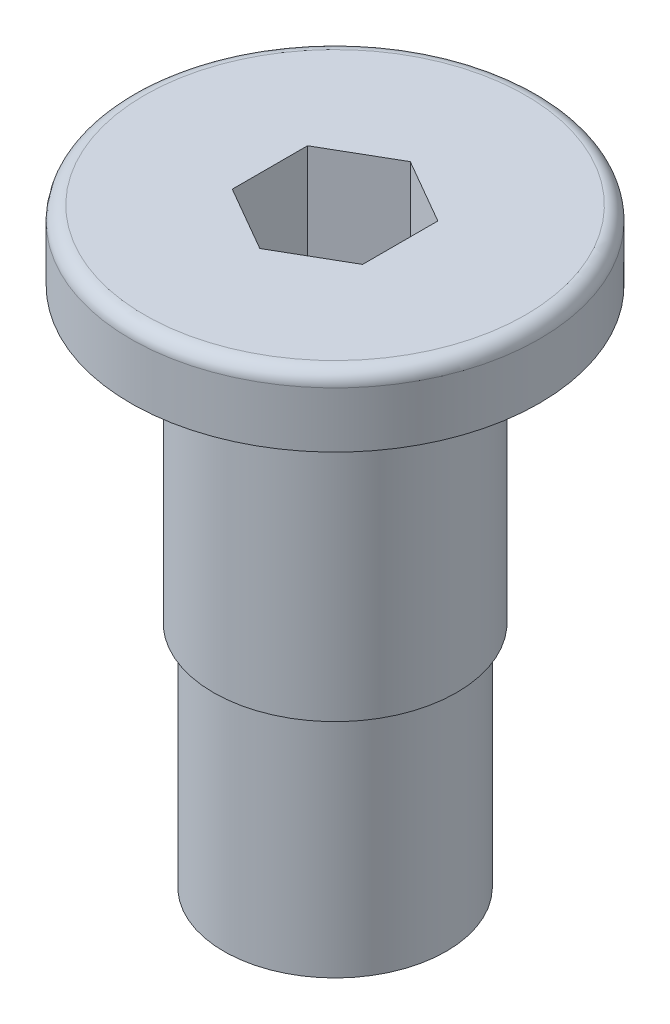
ISO-10303-21;
HEADER;
FILE_DESCRIPTION(('STEP AP214'),'2;1');
FILE_NAME('part.step','',(''),(''),'','','');
FILE_SCHEMA(('AUTOMOTIVE_DESIGN { 1 0 10303 214 1 1 1 1 }'));
ENDSEC;
DATA;
#1=APPLICATION_CONTEXT('core data for automotive mechanical design processes');
#2=APPLICATION_PROTOCOL_DEFINITION('international standard','automotive_design',2000,#1);
#3=PRODUCT_CONTEXT('',#1,'mechanical');
#4=PRODUCT('Part','Part','',(#3));
#5=PRODUCT_RELATED_PRODUCT_CATEGORY('part','',(#4));
#6=PRODUCT_DEFINITION_FORMATION('','',#4);
#7=PRODUCT_DEFINITION_CONTEXT('part definition',#1,'design');
#8=PRODUCT_DEFINITION('design','',#6,#7);
#9=PRODUCT_DEFINITION_SHAPE('','',#8);
#10=(LENGTH_UNIT() NAMED_UNIT(*) SI_UNIT(.MILLI.,.METRE.));
#11=(NAMED_UNIT(*) PLANE_ANGLE_UNIT() SI_UNIT($,.RADIAN.));
#12=(NAMED_UNIT(*) SI_UNIT($,.STERADIAN.) SOLID_ANGLE_UNIT());
#13=UNCERTAINTY_MEASURE_WITH_UNIT(LENGTH_MEASURE(1.E-05),#10,'distance_accuracy_value','');
#14=(GEOMETRIC_REPRESENTATION_CONTEXT(3) GLOBAL_UNCERTAINTY_ASSIGNED_CONTEXT((#13)) GLOBAL_UNIT_ASSIGNED_CONTEXT((#10,
#11,#12)) REPRESENTATION_CONTEXT('',''));
#15=CARTESIAN_POINT('',(0.,0.,0.));
#16=DIRECTION('',(0.,0.,1.));
#17=DIRECTION('',(1.,0.,0.));
#18=AXIS2_PLACEMENT_3D('',#15,#16,#17);
#19=CARTESIAN_POINT('',(0.,-1.27,1.3748153285078));
#20=DIRECTION('',(0.5,0.,0.866025403784439));
#21=DIRECTION('',(0.866025403784439,0.,-0.5));
#22=AXIS2_PLACEMENT_3D('',#19,#20,#21);
#23=PLANE('',#22);
#24=DIRECTION('',(0.,1.,0.));
#25=VECTOR('',#24,1.);
#26=CARTESIAN_POINT('',(1.190625,-1.27,0.687407664253899));
#27=LINE('',#26,#25);
#28=CARTESIAN_POINT('',(1.190625,1.27,0.6874076642539));
#29=VERTEX_POINT('',#28);
#30=CARTESIAN_POINT('',(1.190625,-1.27,0.687407664253899));
#31=VERTEX_POINT('',#30);
#32=EDGE_CURVE('E85',#29,#31,#27,.F.);
#33=ORIENTED_EDGE('',*,*,#32,.T.);
#34=DIRECTION('',(0.866025403784439,0.,-0.5));
#35=VECTOR('',#34,1.);
#36=CARTESIAN_POINT('',(0.,-1.27,1.3748153285078));
#37=LINE('',#36,#35);
#38=CARTESIAN_POINT('',(0.,-1.27,1.3748153285078));
#39=VERTEX_POINT('',#38);
#40=EDGE_CURVE('E74',#39,#31,#37,.T.);
#41=ORIENTED_EDGE('',*,*,#40,.F.);
#42=DIRECTION('',(0.,1.,0.));
#43=VECTOR('',#42,1.);
#44=CARTESIAN_POINT('',(0.,-1.27,1.3748153285078));
#45=LINE('',#44,#43);
#46=CARTESIAN_POINT('',(0.,1.27,1.3748153285078));
#47=VERTEX_POINT('',#46);
#48=EDGE_CURVE('E94',#39,#47,#45,.T.);
#49=ORIENTED_EDGE('',*,*,#48,.T.);
#50=DIRECTION('',(0.866025403784439,0.,-0.5));
#51=VECTOR('',#50,1.);
#52=CARTESIAN_POINT('',(0.,1.27,1.3748153285078));
#53=LINE('',#52,#51);
#54=EDGE_CURVE('E69',#29,#47,#53,.F.);
#55=ORIENTED_EDGE('',*,*,#54,.F.);
#56=EDGE_LOOP('',(#33,#41,#49,#55));
#57=FACE_BOUND('',#56,.T.);
#58=ADVANCED_FACE('F14',(#57),#23,.F.);
#59=CARTESIAN_POINT('',(1.190625,-1.27,0.687407664253899));
#60=DIRECTION('',(1.,0.,0.));
#61=DIRECTION('',(0.,1.,0.));
#62=AXIS2_PLACEMENT_3D('',#59,#60,#61);
#63=PLANE('',#62);
#64=DIRECTION('',(0.,1.,0.));
#65=VECTOR('',#64,1.);
#66=CARTESIAN_POINT('',(1.190625,-1.27,-0.687407664253897));
#67=LINE('',#66,#65);
#68=CARTESIAN_POINT('',(1.190625,1.27,-0.687407664253898));
#69=VERTEX_POINT('',#68);
#70=CARTESIAN_POINT('',(1.190625,-1.27,-0.687407664253898));
#71=VERTEX_POINT('',#70);
#72=EDGE_CURVE('E90',#69,#71,#67,.F.);
#73=ORIENTED_EDGE('',*,*,#72,.T.);
#74=DIRECTION('',(0.,0.,1.));
#75=VECTOR('',#74,1.);
#76=CARTESIAN_POINT('',(1.190625,-1.27,0.687407664253899));
#77=LINE('',#76,#75);
#78=EDGE_CURVE('E78',#31,#71,#77,.F.);
#79=ORIENTED_EDGE('',*,*,#78,.F.);
#80=ORIENTED_EDGE('',*,*,#32,.F.);
#81=DIRECTION('',(0.,0.,1.));
#82=VECTOR('',#81,1.);
#83=CARTESIAN_POINT('',(1.190625,1.27,0.687407664253899));
#84=LINE('',#83,#82);
#85=EDGE_CURVE('E92',#69,#29,#84,.T.);
#86=ORIENTED_EDGE('',*,*,#85,.F.);
#87=EDGE_LOOP('',(#73,#79,#80,#86));
#88=FACE_BOUND('',#87,.T.);
#89=ADVANCED_FACE('F88',(#88),#63,.F.);
#90=CARTESIAN_POINT('',(-1.190625,-1.27,0.687407664253898));
#91=DIRECTION('',(-0.5,0.,0.866025403784439));
#92=DIRECTION('',(0.866025403784439,0.,0.5));
#93=AXIS2_PLACEMENT_3D('',#90,#91,#92);
#94=PLANE('',#93);
#95=ORIENTED_EDGE('',*,*,#48,.F.);
#96=DIRECTION('',(0.866025403784439,0.,0.5));
#97=VECTOR('',#96,1.);
#98=CARTESIAN_POINT('',(-1.190625,-1.27,0.687407664253898));
#99=LINE('',#98,#97);
#100=CARTESIAN_POINT('',(-1.190625,-1.27,0.687407664253898));
#101=VERTEX_POINT('',#100);
#102=EDGE_CURVE('E81',#101,#39,#99,.T.);
#103=ORIENTED_EDGE('',*,*,#102,.F.);
#104=DIRECTION('',(0.,-1.,0.));
#105=VECTOR('',#104,1.);
#106=CARTESIAN_POINT('',(-1.190625,-1.27,0.687407664253898));
#107=LINE('',#106,#105);
#108=CARTESIAN_POINT('',(-1.190625,1.27,0.687407664253898));
#109=VERTEX_POINT('',#108);
#110=EDGE_CURVE('E155',#101,#109,#107,.F.);
#111=ORIENTED_EDGE('',*,*,#110,.T.);
#112=DIRECTION('',(0.866025403784439,0.,0.5));
#113=VECTOR('',#112,1.);
#114=CARTESIAN_POINT('',(-1.190625,1.27,0.687407664253897));
#115=LINE('',#114,#113);
#116=EDGE_CURVE('E167',#47,#109,#115,.F.);
#117=ORIENTED_EDGE('',*,*,#116,.F.);
#118=EDGE_LOOP('',(#95,#103,#111,#117));
#119=FACE_BOUND('',#118,.T.);
#120=ADVANCED_FACE('F170',(#119),#94,.F.);
#121=CARTESIAN_POINT('',(1.190625,-1.27,-0.687407664253898));
#122=DIRECTION('',(0.5,0.,-0.866025403784439));
#123=DIRECTION('',(-0.866025403784439,0.,-0.5));
#124=AXIS2_PLACEMENT_3D('',#121,#122,#123);
#125=PLANE('',#124);
#126=DIRECTION('',(0.,1.,0.));
#127=VECTOR('',#126,1.);
#128=CARTESIAN_POINT('',(0.,-1.27,-1.3748153285078));
#129=LINE('',#128,#127);
#130=CARTESIAN_POINT('',(0.,1.27,-1.3748153285078));
#131=VERTEX_POINT('',#130);
#132=CARTESIAN_POINT('',(0.,-1.27,-1.3748153285078));
#133=VERTEX_POINT('',#132);
#134=EDGE_CURVE('E150',#131,#133,#129,.F.);
#135=ORIENTED_EDGE('',*,*,#134,.T.);
#136=DIRECTION('',(-0.866025403784439,0.,-0.5));
#137=VECTOR('',#136,1.);
#138=CARTESIAN_POINT('',(1.190625,-1.27,-0.687407664253898));
#139=LINE('',#138,#137);
#140=EDGE_CURVE('E161',#71,#133,#139,.T.);
#141=ORIENTED_EDGE('',*,*,#140,.F.);
#142=ORIENTED_EDGE('',*,*,#72,.F.);
#143=DIRECTION('',(-0.866025403784439,0.,-0.5));
#144=VECTOR('',#143,1.);
#145=CARTESIAN_POINT('',(1.190625,1.27,-0.6874076642539));
#146=LINE('',#145,#144);
#147=EDGE_CURVE('E163',#131,#69,#146,.F.);
#148=ORIENTED_EDGE('',*,*,#147,.F.);
#149=EDGE_LOOP('',(#135,#141,#142,#148));
#150=FACE_BOUND('',#149,.T.);
#151=ADVANCED_FACE('F180',(#150),#125,.F.);
#152=CARTESIAN_POINT('',(0.,-1.27,-1.3748153285078));
#153=DIRECTION('',(0.,1.,0.));
#154=DIRECTION('',(-1.,0.,0.));
#155=AXIS2_PLACEMENT_3D('',#152,#153,#154);
#156=PLANE('',#155);
#157=ORIENTED_EDGE('',*,*,#40,.T.);
#158=ORIENTED_EDGE('',*,*,#78,.T.);
#159=ORIENTED_EDGE('',*,*,#140,.T.);
#160=DIRECTION('',(-0.866025403784439,0.,0.5));
#161=VECTOR('',#160,1.);
#162=CARTESIAN_POINT('',(0.,-1.27,-1.3748153285078));
#163=LINE('',#162,#161);
#164=CARTESIAN_POINT('',(-1.190625,-1.27,-0.687407664253899));
#165=VERTEX_POINT('',#164);
#166=EDGE_CURVE('E148',#133,#165,#163,.T.);
#167=ORIENTED_EDGE('',*,*,#166,.T.);
#168=DIRECTION('',(0.,0.,1.));
#169=VECTOR('',#168,1.);
#170=CARTESIAN_POINT('',(-1.190625,-1.27,-0.687407664253899));
#171=LINE('',#170,#169);
#172=EDGE_CURVE('E158',#165,#101,#171,.T.);
#173=ORIENTED_EDGE('',*,*,#172,.T.);
#174=ORIENTED_EDGE('',*,*,#102,.T.);
#175=EDGE_LOOP('',(#157,#158,#159,#167,#173,#174));
#176=FACE_BOUND('',#175,.T.);
#177=ADVANCED_FACE('F75',(#176),#156,.T.);
#178=CARTESIAN_POINT('',(-1.190625,-1.27,-0.687407664253899));
#179=DIRECTION('',(-1.,0.,0.));
#180=DIRECTION('',(0.,-1.,0.));
#181=AXIS2_PLACEMENT_3D('',#178,#179,#180);
#182=PLANE('',#181);
#183=ORIENTED_EDGE('',*,*,#110,.F.);
#184=ORIENTED_EDGE('',*,*,#172,.F.);
#185=DIRECTION('',(0.,1.,0.));
#186=VECTOR('',#185,1.);
#187=CARTESIAN_POINT('',(-1.190625,-1.27,-0.687407664253899));
#188=LINE('',#187,#186);
#189=CARTESIAN_POINT('',(-1.190625,1.27,-0.687407664253898));
#190=VERTEX_POINT('',#189);
#191=EDGE_CURVE('E139',#165,#190,#188,.T.);
#192=ORIENTED_EDGE('',*,*,#191,.T.);
#193=DIRECTION('',(0.,0.,1.));
#194=VECTOR('',#193,1.);
#195=CARTESIAN_POINT('',(-1.190625,1.27,-0.687407664253899));
#196=LINE('',#195,#194);
#197=EDGE_CURVE('E152',#109,#190,#196,.F.);
#198=ORIENTED_EDGE('',*,*,#197,.F.);
#199=EDGE_LOOP('',(#183,#184,#192,#198));
#200=FACE_BOUND('',#199,.T.);
#201=ADVANCED_FACE('F187',(#200),#182,.F.);
#202=CARTESIAN_POINT('',(0.,-1.27,-1.3748153285078));
#203=DIRECTION('',(-0.5,0.,-0.866025403784439));
#204=DIRECTION('',(-0.866025403784439,0.,0.5));
#205=AXIS2_PLACEMENT_3D('',#202,#203,#204);
#206=PLANE('',#205);
#207=ORIENTED_EDGE('',*,*,#191,.F.);
#208=ORIENTED_EDGE('',*,*,#166,.F.);
#209=ORIENTED_EDGE('',*,*,#134,.F.);
#210=DIRECTION('',(0.866025403784439,0.,-0.5));
#211=VECTOR('',#210,1.);
#212=CARTESIAN_POINT('',(-1.190625,1.27,-0.687407664253899));
#213=LINE('',#212,#211);
#214=EDGE_CURVE('E147',#190,#131,#213,.T.);
#215=ORIENTED_EDGE('',*,*,#214,.F.);
#216=EDGE_LOOP('',(#207,#208,#209,#215));
#217=FACE_BOUND('',#216,.T.);
#218=ADVANCED_FACE('F185',(#217),#206,.F.);
#219=CARTESIAN_POINT('',(0.,1.27,0.));
#220=DIRECTION('',(0.,1.,0.));
#221=DIRECTION('',(-1.,0.,0.));
#222=AXIS2_PLACEMENT_3D('',#219,#220,#221);
#223=PLANE('',#222);
#224=ORIENTED_EDGE('',*,*,#197,.T.);
#225=ORIENTED_EDGE('',*,*,#214,.T.);
#226=ORIENTED_EDGE('',*,*,#147,.T.);
#227=ORIENTED_EDGE('',*,*,#85,.T.);
#228=ORIENTED_EDGE('',*,*,#54,.T.);
#229=ORIENTED_EDGE('',*,*,#116,.T.);
#230=EDGE_LOOP('',(#224,#225,#226,#227,#228,#229));
#231=FACE_BOUND('',#230,.T.);
#232=CARTESIAN_POINT('',(0.,1.27,0.));
#233=DIRECTION('',(0.,-1.,0.));
#234=DIRECTION('',(1.,0.,0.));
#235=AXIS2_PLACEMENT_3D('',#232,#233,#234);
#236=CIRCLE('',#235,3.4798);
#237=CARTESIAN_POINT('',(3.47980000000001,1.27,0.));
#238=VERTEX_POINT('',#237);
#239=CARTESIAN_POINT('',(-3.47979999999999,1.27000000000001,0.));
#240=VERTEX_POINT('',#239);
#241=EDGE_CURVE('E33',#238,#240,#236,.T.);
#242=ORIENTED_EDGE('',*,*,#241,.F.);
#243=CARTESIAN_POINT('',(0.,1.27,0.));
#244=DIRECTION('',(0.,-1.,0.));
#245=DIRECTION('',(-1.,0.,0.));
#246=AXIS2_PLACEMENT_3D('',#243,#244,#245);
#247=CIRCLE('',#246,3.4798);
#248=EDGE_CURVE('E113',#240,#238,#247,.T.);
#249=ORIENTED_EDGE('',*,*,#248,.F.);
#250=EDGE_LOOP('',(#242,#249));
#251=FACE_BOUND('',#250,.T.);
#252=ADVANCED_FACE('F127',(#231,#251),#223,.T.);
#253=CARTESIAN_POINT('',(0.,1.016,0.));
#254=DIRECTION('',(0.,1.,0.));
#255=DIRECTION('',(-1.,0.,0.));
#256=AXIS2_PLACEMENT_3D('',#253,#254,#255);
#257=TOROIDAL_SURFACE('',#256,3.4798,0.254);
#258=CARTESIAN_POINT('',(0.,1.016,0.));
#259=DIRECTION('',(0.,-1.,0.));
#260=DIRECTION('',(1.,0.,0.));
#261=AXIS2_PLACEMENT_3D('',#258,#259,#260);
#262=CIRCLE('',#261,3.7338);
#263=CARTESIAN_POINT('',(3.73380000000001,1.016,0.));
#264=VERTEX_POINT('',#263);
#265=EDGE_CURVE('E109',#264,#264,#262,.T.);
#266=ORIENTED_EDGE('',*,*,#265,.F.);
#267=EDGE_LOOP('',(#266));
#268=FACE_BOUND('',#267,.T.);
#269=ORIENTED_EDGE('',*,*,#248,.T.);
#270=ORIENTED_EDGE('',*,*,#241,.T.);
#271=EDGE_LOOP('',(#269,#270));
#272=FACE_BOUND('',#271,.T.);
#273=ADVANCED_FACE('F121',(#268,#272),#257,.T.);
#274=CARTESIAN_POINT('',(2.032,-9.525,0.));
#275=DIRECTION('',(0.,-1.,0.));
#276=DIRECTION('',(1.,0.,0.));
#277=AXIS2_PLACEMENT_3D('',#274,#275,#276);
#278=PLANE('',#277);
#279=CARTESIAN_POINT('',(0.,-9.525,0.));
#280=DIRECTION('',(0.,-1.,0.));
#281=DIRECTION('',(1.,0.,0.));
#282=AXIS2_PLACEMENT_3D('',#279,#280,#281);
#283=CIRCLE('',#282,2.032);
#284=CARTESIAN_POINT('',(2.032,-9.525,0.));
#285=VERTEX_POINT('',#284);
#286=EDGE_CURVE('E107',#285,#285,#283,.F.);
#287=ORIENTED_EDGE('',*,*,#286,.F.);
#288=EDGE_LOOP('',(#287));
#289=FACE_BOUND('',#288,.T.);
#290=ADVANCED_FACE('F126',(#289),#278,.T.);
#291=CARTESIAN_POINT('',(0.,-9.525,0.));
#292=DIRECTION('',(0.,-1.,0.));
#293=DIRECTION('',(1.,0.,0.));
#294=AXIS2_PLACEMENT_3D('',#291,#292,#293);
#295=CYLINDRICAL_SURFACE('',#294,3.7338);
#296=ORIENTED_EDGE('',*,*,#265,.T.);
#297=EDGE_LOOP('',(#296));
#298=FACE_BOUND('',#297,.T.);
#299=CARTESIAN_POINT('',(0.,0.,0.));
#300=DIRECTION('',(0.,-1.,0.));
#301=DIRECTION('',(1.,0.,0.));
#302=AXIS2_PLACEMENT_3D('',#299,#300,#301);
#303=CIRCLE('',#302,3.7338);
#304=CARTESIAN_POINT('',(3.73380000000001,0.,0.));
#305=VERTEX_POINT('',#304);
#306=EDGE_CURVE('E104',#305,#305,#303,.T.);
#307=ORIENTED_EDGE('',*,*,#306,.F.);
#308=EDGE_LOOP('',(#307));
#309=FACE_BOUND('',#308,.T.);
#310=ADVANCED_FACE('F214',(#298,#309),#295,.T.);
#311=CARTESIAN_POINT('',(0.,-9.525,0.));
#312=DIRECTION('',(0.,-1.,0.));
#313=DIRECTION('',(1.,0.,0.));
#314=AXIS2_PLACEMENT_3D('',#311,#312,#313);
#315=CYLINDRICAL_SURFACE('',#314,2.032);
#316=CARTESIAN_POINT('',(0.,-5.334,0.));
#317=DIRECTION('',(0.,-1.,0.));
#318=DIRECTION('',(1.,0.,0.));
#319=AXIS2_PLACEMENT_3D('',#316,#317,#318);
#320=CIRCLE('',#319,2.032);
#321=CARTESIAN_POINT('',(2.032,-5.334,0.));
#322=VERTEX_POINT('',#321);
#323=EDGE_CURVE('E101',#322,#322,#320,.F.);
#324=ORIENTED_EDGE('',*,*,#323,.F.);
#325=EDGE_LOOP('',(#324));
#326=FACE_BOUND('',#325,.T.);
#327=ORIENTED_EDGE('',*,*,#286,.T.);
#328=EDGE_LOOP('',(#327));
#329=FACE_BOUND('',#328,.T.);
#330=ADVANCED_FACE('F211',(#326,#329),#315,.T.);
#331=CARTESIAN_POINT('',(3.73380000000001,0.,0.));
#332=DIRECTION('',(0.,-1.,0.));
#333=DIRECTION('',(1.,0.,0.));
#334=AXIS2_PLACEMENT_3D('',#331,#332,#333);
#335=PLANE('',#334);
#336=CARTESIAN_POINT('',(0.,0.,0.));
#337=DIRECTION('',(0.,-1.,0.));
#338=DIRECTION('',(1.,0.,0.));
#339=AXIS2_PLACEMENT_3D('',#336,#337,#338);
#340=CIRCLE('',#339,2.22249999999999);
#341=CARTESIAN_POINT('',(2.2225,0.,0.));
#342=VERTEX_POINT('',#341);
#343=EDGE_CURVE('E25',#342,#342,#340,.T.);
#344=ORIENTED_EDGE('',*,*,#343,.F.);
#345=EDGE_LOOP('',(#344));
#346=FACE_BOUND('',#345,.T.);
#347=ORIENTED_EDGE('',*,*,#306,.T.);
#348=EDGE_LOOP('',(#347));
#349=FACE_BOUND('',#348,.T.);
#350=ADVANCED_FACE('F204',(#346,#349),#335,.T.);
#351=CARTESIAN_POINT('',(2.2225,-5.334,0.));
#352=DIRECTION('',(0.,-1.,0.));
#353=DIRECTION('',(1.,0.,0.));
#354=AXIS2_PLACEMENT_3D('',#351,#352,#353);
#355=PLANE('',#354);
#356=ORIENTED_EDGE('',*,*,#323,.T.);
#357=EDGE_LOOP('',(#356));
#358=FACE_BOUND('',#357,.T.);
#359=CARTESIAN_POINT('',(0.,-5.334,0.));
#360=DIRECTION('',(0.,-1.,0.));
#361=DIRECTION('',(1.,0.,0.));
#362=AXIS2_PLACEMENT_3D('',#359,#360,#361);
#363=CIRCLE('',#362,2.22249999999999);
#364=CARTESIAN_POINT('',(2.2225,-5.334,0.));
#365=VERTEX_POINT('',#364);
#366=EDGE_CURVE('E9',#365,#365,#363,.F.);
#367=ORIENTED_EDGE('',*,*,#366,.F.);
#368=EDGE_LOOP('',(#367));
#369=FACE_BOUND('',#368,.T.);
#370=ADVANCED_FACE('F198',(#358,#369),#355,.T.);
#371=CARTESIAN_POINT('',(0.,-9.525,0.));
#372=DIRECTION('',(0.,-1.,0.));
#373=DIRECTION('',(1.,0.,0.));
#374=AXIS2_PLACEMENT_3D('',#371,#372,#373);
#375=CYLINDRICAL_SURFACE('',#374,2.22249999999999);
#376=ORIENTED_EDGE('',*,*,#366,.T.);
#377=EDGE_LOOP('',(#376));
#378=FACE_BOUND('',#377,.T.);
#379=ORIENTED_EDGE('',*,*,#343,.T.);
#380=EDGE_LOOP('',(#379));
#381=FACE_BOUND('',#380,.T.);
#382=ADVANCED_FACE('F196',(#378,#381),#375,.T.);
#383=CLOSED_SHELL('',(#58,#89,#120,#151,#177,#201,#218,#252,#273,#290,#310,#330,#350,#370,#382));
#384=MANIFOLD_SOLID_BREP('B1',#383);
#385=ADVANCED_BREP_SHAPE_REPRESENTATION('',(#18,#384),#14);
#386=SHAPE_DEFINITION_REPRESENTATION(#9,#385);
ENDSEC;
END-ISO-10303-21;
